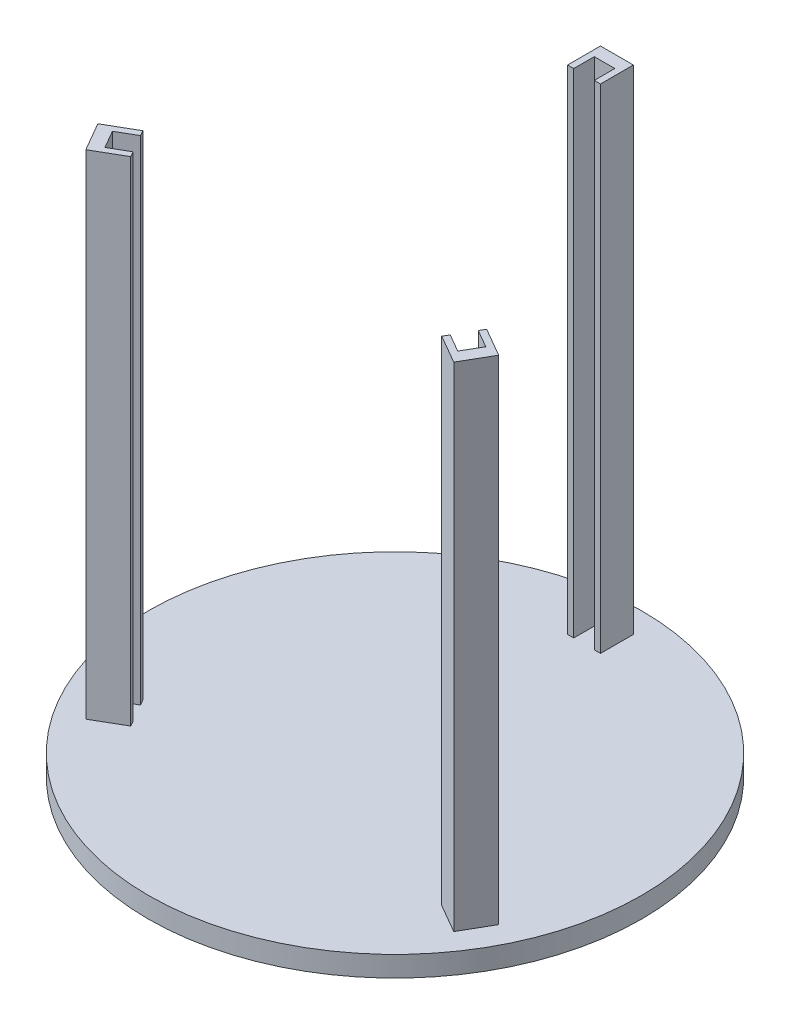
ISO-10303-21;
HEADER;
FILE_DESCRIPTION(('STEP AP214'),'2;1');
FILE_NAME('part.step','',(''),(''),'','','');
FILE_SCHEMA(('AUTOMOTIVE_DESIGN { 1 0 10303 214 1 1 1 1 }'));
ENDSEC;
DATA;
#1=APPLICATION_CONTEXT('core data for automotive mechanical design processes');
#2=APPLICATION_PROTOCOL_DEFINITION('international standard','automotive_design',2000,#1);
#3=PRODUCT_CONTEXT('',#1,'mechanical');
#4=PRODUCT('Part','Part','',(#3));
#5=PRODUCT_RELATED_PRODUCT_CATEGORY('part','',(#4));
#6=PRODUCT_DEFINITION_FORMATION('','',#4);
#7=PRODUCT_DEFINITION_CONTEXT('part definition',#1,'design');
#8=PRODUCT_DEFINITION('design','',#6,#7);
#9=PRODUCT_DEFINITION_SHAPE('','',#8);
#10=(LENGTH_UNIT() NAMED_UNIT(*) SI_UNIT(.MILLI.,.METRE.));
#11=(NAMED_UNIT(*) PLANE_ANGLE_UNIT() SI_UNIT($,.RADIAN.));
#12=(NAMED_UNIT(*) SI_UNIT($,.STERADIAN.) SOLID_ANGLE_UNIT());
#13=UNCERTAINTY_MEASURE_WITH_UNIT(LENGTH_MEASURE(1.E-05),#10,'distance_accuracy_value','');
#14=(GEOMETRIC_REPRESENTATION_CONTEXT(3) GLOBAL_UNCERTAINTY_ASSIGNED_CONTEXT((#13)) GLOBAL_UNIT_ASSIGNED_CONTEXT((#10,
#11,#12)) REPRESENTATION_CONTEXT('',''));
#15=CARTESIAN_POINT('',(0.,0.,0.));
#16=DIRECTION('',(0.,0.,1.));
#17=DIRECTION('',(1.,0.,0.));
#18=AXIS2_PLACEMENT_3D('',#15,#16,#17);
#19=CARTESIAN_POINT('',(209.185842870422,625.,97.6794919243093));
#20=DIRECTION('',(0.866025403784443,0.,0.499999999999992));
#21=DIRECTION('',(0.499999999999992,0.,-0.866025403784443));
#22=AXIS2_PLACEMENT_3D('',#19,#20,#21);
#23=PLANE('',#22);
#24=DIRECTION('',(-0.499999999999992,0.,0.866025403784443));
#25=VECTOR('',#24,1.);
#26=CARTESIAN_POINT('',(209.185842870422,25.,97.6794919243093));
#27=LINE('',#26,#25);
#28=CARTESIAN_POINT('',(209.185842870422,25.,97.6794919243093));
#29=VERTEX_POINT('',#28);
#30=CARTESIAN_POINT('',(205.45728406955,25.,104.137545206428));
#31=VERTEX_POINT('',#30);
#32=EDGE_CURVE('E218',#29,#31,#27,.T.);
#33=ORIENTED_EDGE('',*,*,#32,.T.);
#34=DIRECTION('',(0.,1.,0.));
#35=VECTOR('',#34,1.);
#36=CARTESIAN_POINT('',(205.45728406955,25.,104.137545206428));
#37=LINE('',#36,#35);
#38=CARTESIAN_POINT('',(205.45728406955,625.,104.137545206428));
#39=VERTEX_POINT('',#38);
#40=EDGE_CURVE('E468',#31,#39,#37,.T.);
#41=ORIENTED_EDGE('',*,*,#40,.T.);
#42=DIRECTION('',(-0.499999999999992,0.,0.866025403784443));
#43=VECTOR('',#42,1.);
#44=CARTESIAN_POINT('',(209.185842870422,625.,97.6794919243093));
#45=LINE('',#44,#43);
#46=CARTESIAN_POINT('',(209.185842870422,625.,97.6794919243093));
#47=VERTEX_POINT('',#46);
#48=EDGE_CURVE('E231',#47,#39,#45,.T.);
#49=ORIENTED_EDGE('',*,*,#48,.F.);
#50=DIRECTION('',(0.,-1.,0.));
#51=VECTOR('',#50,1.);
#52=CARTESIAN_POINT('',(209.185842870422,625.,97.6794919243093));
#53=LINE('',#52,#51);
#54=EDGE_CURVE('E230',#47,#29,#53,.T.);
#55=ORIENTED_EDGE('',*,*,#54,.T.);
#56=EDGE_LOOP('',(#33,#41,#49,#55));
#57=FACE_BOUND('',#56,.T.);
#58=ADVANCED_FACE('F33',(#57),#23,.F.);
#59=CARTESIAN_POINT('',(-189.18584287042,625.,132.32050807569));
#60=DIRECTION('',(-0.866025403784436,0.,0.500000000000004));
#61=DIRECTION('',(0.500000000000004,0.,0.866025403784436));
#62=AXIS2_PLACEMENT_3D('',#59,#60,#61);
#63=PLANE('',#62);
#64=DIRECTION('',(-0.500000000000004,0.,-0.866025403784436));
#65=VECTOR('',#64,1.);
#66=CARTESIAN_POINT('',(-189.18584287042,25.,132.32050807569));
#67=LINE('',#66,#65);
#68=CARTESIAN_POINT('',(-189.18584287042,25.,132.32050807569));
#69=VERTEX_POINT('',#68);
#70=CARTESIAN_POINT('',(-192.914401671292,25.,125.862454793572));
#71=VERTEX_POINT('',#70);
#72=EDGE_CURVE('E243',#69,#71,#67,.T.);
#73=ORIENTED_EDGE('',*,*,#72,.T.);
#74=DIRECTION('',(0.,1.,0.));
#75=VECTOR('',#74,1.);
#76=CARTESIAN_POINT('',(-192.914401671292,25.,125.862454793572));
#77=LINE('',#76,#75);
#78=CARTESIAN_POINT('',(-192.914401671292,625.,125.862454793572));
#79=VERTEX_POINT('',#78);
#80=EDGE_CURVE('E471',#71,#79,#77,.T.);
#81=ORIENTED_EDGE('',*,*,#80,.T.);
#82=DIRECTION('',(-0.500000000000004,0.,-0.866025403784436));
#83=VECTOR('',#82,1.);
#84=CARTESIAN_POINT('',(-189.18584287042,625.,132.32050807569));
#85=LINE('',#84,#83);
#86=CARTESIAN_POINT('',(-189.18584287042,625.,132.32050807569));
#87=VERTEX_POINT('',#86);
#88=EDGE_CURVE('E248',#87,#79,#85,.T.);
#89=ORIENTED_EDGE('',*,*,#88,.F.);
#90=DIRECTION('',(0.,-1.,0.));
#91=VECTOR('',#90,1.);
#92=CARTESIAN_POINT('',(-189.18584287042,625.,132.32050807569));
#93=LINE('',#92,#91);
#94=EDGE_CURVE('E264',#87,#69,#93,.T.);
#95=ORIENTED_EDGE('',*,*,#94,.T.);
#96=EDGE_LOOP('',(#73,#81,#89,#95));
#97=FACE_BOUND('',#96,.T.);
#98=ADVANCED_FACE('F349',(#97),#63,.F.);
#99=CARTESIAN_POINT('',(0.,25.,0.));
#100=DIRECTION('',(0.,1.,0.));
#101=DIRECTION('',(0.,0.,1.));
#102=AXIS2_PLACEMENT_3D('',#99,#100,#101);
#103=PLANE('',#102);
#104=CARTESIAN_POINT('',(0.,25.,0.));
#105=DIRECTION('',(0.,1.,0.));
#106=DIRECTION('',(0.,0.,1.));
#107=AXIS2_PLACEMENT_3D('',#104,#105,#106);
#108=CIRCLE('',#107,300.);
#109=CARTESIAN_POINT('',(0.,25.,300.));
#110=VERTEX_POINT('',#109);
#111=EDGE_CURVE('E11',#110,#110,#108,.T.);
#112=ORIENTED_EDGE('',*,*,#111,.T.);
#113=EDGE_LOOP('',(#112));
#114=FACE_BOUND('',#113,.T.);
#115=DIRECTION('',(-1.,0.,0.));
#116=VECTOR('',#115,1.);
#117=CARTESIAN_POINT('',(-20.,25.,-270.));
#118=LINE('',#117,#116);
#119=CARTESIAN_POINT('',(20.,25.,-270.));
#120=VERTEX_POINT('',#119);
#121=CARTESIAN_POINT('',(-20.,25.,-270.));
#122=VERTEX_POINT('',#121);
#123=EDGE_CURVE('E313',#120,#122,#118,.T.);
#124=ORIENTED_EDGE('',*,*,#123,.F.);
#125=DIRECTION('',(0.,0.,-1.));
#126=VECTOR('',#125,1.);
#127=CARTESIAN_POINT('',(20.,25.,-230.));
#128=LINE('',#127,#126);
#129=CARTESIAN_POINT('',(20.,25.,-230.));
#130=VERTEX_POINT('',#129);
#131=EDGE_CURVE('E292',#130,#120,#128,.T.);
#132=ORIENTED_EDGE('',*,*,#131,.F.);
#133=DIRECTION('',(1.,0.,0.));
#134=VECTOR('',#133,1.);
#135=CARTESIAN_POINT('',(-20.,25.,-230.));
#136=LINE('',#135,#134);
#137=CARTESIAN_POINT('',(12.4571176017438,25.,-230.));
#138=VERTEX_POINT('',#137);
#139=EDGE_CURVE('E318',#138,#130,#136,.T.);
#140=ORIENTED_EDGE('',*,*,#139,.F.);
#141=DIRECTION('',(0.,0.,-1.));
#142=VECTOR('',#141,1.);
#143=CARTESIAN_POINT('',(12.4571176017438,25.,-255.));
#144=LINE('',#143,#142);
#145=CARTESIAN_POINT('',(12.4571176017438,25.,-255.));
#146=VERTEX_POINT('',#145);
#147=EDGE_CURVE('E272',#138,#146,#144,.T.);
#148=ORIENTED_EDGE('',*,*,#147,.T.);
#149=DIRECTION('',(-1.,0.,0.));
#150=VECTOR('',#149,1.);
#151=CARTESIAN_POINT('',(-12.5428823982562,25.,-255.));
#152=LINE('',#151,#150);
#153=CARTESIAN_POINT('',(-12.5428823982562,25.,-255.));
#154=VERTEX_POINT('',#153);
#155=EDGE_CURVE('E275',#146,#154,#152,.T.);
#156=ORIENTED_EDGE('',*,*,#155,.T.);
#157=DIRECTION('',(0.,0.,1.));
#158=VECTOR('',#157,1.);
#159=CARTESIAN_POINT('',(-12.5428823982562,25.,-230.));
#160=LINE('',#159,#158);
#161=CARTESIAN_POINT('',(-12.5428823982562,25.,-230.));
#162=VERTEX_POINT('',#161);
#163=EDGE_CURVE('E279',#154,#162,#160,.T.);
#164=ORIENTED_EDGE('',*,*,#163,.T.);
#165=CARTESIAN_POINT('',(-20.,25.,-230.));
#166=VERTEX_POINT('',#165);
#167=EDGE_CURVE('E302',#166,#162,#136,.T.);
#168=ORIENTED_EDGE('',*,*,#167,.F.);
#169=DIRECTION('',(0.,0.,1.));
#170=VECTOR('',#169,1.);
#171=CARTESIAN_POINT('',(-20.,25.,-230.));
#172=LINE('',#171,#170);
#173=EDGE_CURVE('E315',#122,#166,#172,.T.);
#174=ORIENTED_EDGE('',*,*,#173,.F.);
#175=EDGE_LOOP('',(#124,#132,#140,#148,#156,#164,#168,#174));
#176=FACE_BOUND('',#175,.T.);
#177=DIRECTION('',(0.500000000000004,0.,0.866025403784436));
#178=VECTOR('',#177,1.);
#179=CARTESIAN_POINT('',(-223.826859021798,25.,152.32050807569));
#180=LINE('',#179,#178);
#181=CARTESIAN_POINT('',(-243.826859021798,25.,117.679491924312));
#182=VERTEX_POINT('',#181);
#183=CARTESIAN_POINT('',(-223.826859021798,25.,152.32050807569));
#184=VERTEX_POINT('',#183);
#185=EDGE_CURVE('E254',#182,#184,#180,.T.);
#186=ORIENTED_EDGE('',*,*,#185,.F.);
#187=DIRECTION('',(-0.866025403784436,0.,0.500000000000004));
#188=VECTOR('',#187,1.);
#189=CARTESIAN_POINT('',(-209.18584287042,25.,97.6794919243122));
#190=LINE('',#189,#188);
#191=CARTESIAN_POINT('',(-209.18584287042,25.,97.6794919243122));
#192=VERTEX_POINT('',#191);
#193=EDGE_CURVE('E238',#192,#182,#190,.T.);
#194=ORIENTED_EDGE('',*,*,#193,.F.);
#195=CARTESIAN_POINT('',(-205.414401671292,25.,104.211819698961));
#196=VERTEX_POINT('',#195);
#197=EDGE_CURVE('E259',#196,#192,#67,.T.);
#198=ORIENTED_EDGE('',*,*,#197,.F.);
#199=DIRECTION('',(-0.866025403784436,0.,0.500000000000004));
#200=VECTOR('',#199,1.);
#201=CARTESIAN_POINT('',(-227.065036765903,25.,116.711819698961));
#202=LINE('',#201,#200);
#203=CARTESIAN_POINT('',(-227.065036765903,25.,116.711819698961));
#204=VERTEX_POINT('',#203);
#205=EDGE_CURVE('E452',#196,#204,#202,.T.);
#206=ORIENTED_EDGE('',*,*,#205,.T.);
#207=DIRECTION('',(0.500000000000002,0.,0.866025403784438));
#208=VECTOR('',#207,1.);
#209=CARTESIAN_POINT('',(-214.565036765903,25.,138.362454793572));
#210=LINE('',#209,#208);
#211=CARTESIAN_POINT('',(-214.565036765903,25.,138.362454793572));
#212=VERTEX_POINT('',#211);
#213=EDGE_CURVE('E455',#204,#212,#210,.T.);
#214=ORIENTED_EDGE('',*,*,#213,.T.);
#215=DIRECTION('',(0.866025403784436,0.,-0.500000000000004));
#216=VECTOR('',#215,1.);
#217=CARTESIAN_POINT('',(-192.914401671292,25.,125.862454793572));
#218=LINE('',#217,#216);
#219=EDGE_CURVE('E459',#212,#71,#218,.T.);
#220=ORIENTED_EDGE('',*,*,#219,.T.);
#221=ORIENTED_EDGE('',*,*,#72,.F.);
#222=DIRECTION('',(0.866025403784436,0.,-0.500000000000004));
#223=VECTOR('',#222,1.);
#224=CARTESIAN_POINT('',(-189.18584287042,25.,132.32050807569));
#225=LINE('',#224,#223);
#226=EDGE_CURVE('E256',#184,#69,#225,.T.);
#227=ORIENTED_EDGE('',*,*,#226,.F.);
#228=EDGE_LOOP('',(#186,#194,#198,#206,#214,#220,#221,#227));
#229=FACE_BOUND('',#228,.T.);
#230=DIRECTION('',(0.499999999999992,0.,-0.866025403784443));
#231=VECTOR('',#230,1.);
#232=CARTESIAN_POINT('',(243.8268590218,25.,117.679491924309));
#233=LINE('',#232,#231);
#234=CARTESIAN_POINT('',(223.8268590218,25.,152.320508075687));
#235=VERTEX_POINT('',#234);
#236=CARTESIAN_POINT('',(243.8268590218,25.,117.679491924309));
#237=VERTEX_POINT('',#236);
#238=EDGE_CURVE('E224',#235,#237,#233,.T.);
#239=ORIENTED_EDGE('',*,*,#238,.F.);
#240=DIRECTION('',(0.866025403784443,0.,0.499999999999992));
#241=VECTOR('',#240,1.);
#242=CARTESIAN_POINT('',(189.185842870422,25.,132.320508075687));
#243=LINE('',#242,#241);
#244=CARTESIAN_POINT('',(189.185842870422,25.,132.320508075687));
#245=VERTEX_POINT('',#244);
#246=EDGE_CURVE('E217',#245,#235,#243,.T.);
#247=ORIENTED_EDGE('',*,*,#246,.F.);
#248=CARTESIAN_POINT('',(192.95728406955,25.,125.788180301039));
#249=VERTEX_POINT('',#248);
#250=EDGE_CURVE('E208',#249,#245,#27,.T.);
#251=ORIENTED_EDGE('',*,*,#250,.F.);
#252=DIRECTION('',(0.866025403784443,0.,0.499999999999992));
#253=VECTOR('',#252,1.);
#254=CARTESIAN_POINT('',(214.607919164161,25.,138.288180301038));
#255=LINE('',#254,#253);
#256=CARTESIAN_POINT('',(214.607919164161,25.,138.288180301038));
#257=VERTEX_POINT('',#256);
#258=EDGE_CURVE('E194',#249,#257,#255,.T.);
#259=ORIENTED_EDGE('',*,*,#258,.T.);
#260=DIRECTION('',(0.499999999999994,0.,-0.866025403784442));
#261=VECTOR('',#260,1.);
#262=CARTESIAN_POINT('',(227.107919164161,25.,116.637545206427));
#263=LINE('',#262,#261);
#264=CARTESIAN_POINT('',(227.107919164161,25.,116.637545206427));
#265=VERTEX_POINT('',#264);
#266=EDGE_CURVE('E201',#257,#265,#263,.T.);
#267=ORIENTED_EDGE('',*,*,#266,.T.);
#268=DIRECTION('',(-0.866025403784443,0.,-0.499999999999992));
#269=VECTOR('',#268,1.);
#270=CARTESIAN_POINT('',(205.45728406955,25.,104.137545206428));
#271=LINE('',#270,#269);
#272=EDGE_CURVE('E211',#265,#31,#271,.T.);
#273=ORIENTED_EDGE('',*,*,#272,.T.);
#274=ORIENTED_EDGE('',*,*,#32,.F.);
#275=DIRECTION('',(-0.866025403784443,0.,-0.499999999999992));
#276=VECTOR('',#275,1.);
#277=CARTESIAN_POINT('',(209.185842870422,25.,97.6794919243093));
#278=LINE('',#277,#276);
#279=EDGE_CURVE('E219',#237,#29,#278,.T.);
#280=ORIENTED_EDGE('',*,*,#279,.F.);
#281=EDGE_LOOP('',(#239,#247,#251,#259,#267,#273,#274,#280));
#282=FACE_BOUND('',#281,.T.);
#283=ADVANCED_FACE('F215',(#114,#176,#229,#282),#103,.T.);
#284=CARTESIAN_POINT('',(-20.,625.,-230.));
#285=DIRECTION('',(0.,0.,-1.));
#286=DIRECTION('',(-1.,0.,0.));
#287=AXIS2_PLACEMENT_3D('',#284,#285,#286);
#288=PLANE('',#287);
#289=ORIENTED_EDGE('',*,*,#167,.T.);
#290=DIRECTION('',(0.,1.,0.));
#291=VECTOR('',#290,1.);
#292=CARTESIAN_POINT('',(-12.5428823982562,25.,-230.));
#293=LINE('',#292,#291);
#294=CARTESIAN_POINT('',(-12.5428823982562,625.,-230.));
#295=VERTEX_POINT('',#294);
#296=EDGE_CURVE('E289',#162,#295,#293,.T.);
#297=ORIENTED_EDGE('',*,*,#296,.T.);
#298=DIRECTION('',(1.,0.,0.));
#299=VECTOR('',#298,1.);
#300=CARTESIAN_POINT('',(-20.,625.,-230.));
#301=LINE('',#300,#299);
#302=CARTESIAN_POINT('',(-20.,625.,-230.));
#303=VERTEX_POINT('',#302);
#304=EDGE_CURVE('E307',#303,#295,#301,.T.);
#305=ORIENTED_EDGE('',*,*,#304,.F.);
#306=DIRECTION('',(0.,-1.,0.));
#307=VECTOR('',#306,1.);
#308=CARTESIAN_POINT('',(-20.,625.,-230.));
#309=LINE('',#308,#307);
#310=EDGE_CURVE('E323',#303,#166,#309,.T.);
#311=ORIENTED_EDGE('',*,*,#310,.T.);
#312=EDGE_LOOP('',(#289,#297,#305,#311));
#313=FACE_BOUND('',#312,.T.);
#314=ADVANCED_FACE('F345',(#313),#288,.F.);
#315=CARTESIAN_POINT('',(0.,25.,0.));
#316=DIRECTION('',(0.,-1.,0.));
#317=DIRECTION('',(0.,0.,-1.));
#318=AXIS2_PLACEMENT_3D('',#315,#316,#317);
#319=CYLINDRICAL_SURFACE('',#318,300.);
#320=ORIENTED_EDGE('',*,*,#111,.F.);
#321=EDGE_LOOP('',(#320));
#322=FACE_BOUND('',#321,.T.);
#323=CARTESIAN_POINT('',(0.,0.,0.));
#324=DIRECTION('',(0.,1.,0.));
#325=DIRECTION('',(0.,0.,1.));
#326=AXIS2_PLACEMENT_3D('',#323,#324,#325);
#327=CIRCLE('',#326,300.);
#328=CARTESIAN_POINT('',(0.,0.,300.));
#329=VERTEX_POINT('',#328);
#330=EDGE_CURVE('E37',#329,#329,#327,.T.);
#331=ORIENTED_EDGE('',*,*,#330,.T.);
#332=EDGE_LOOP('',(#331));
#333=FACE_BOUND('',#332,.T.);
#334=ADVANCED_FACE('F35',(#322,#333),#319,.T.);
#335=CARTESIAN_POINT('',(0.,0.,0.));
#336=DIRECTION('',(0.,1.,0.));
#337=DIRECTION('',(0.,0.,1.));
#338=AXIS2_PLACEMENT_3D('',#335,#336,#337);
#339=PLANE('',#338);
#340=ORIENTED_EDGE('',*,*,#330,.F.);
#341=EDGE_LOOP('',(#340));
#342=FACE_BOUND('',#341,.T.);
#343=ADVANCED_FACE('F335',(#342),#339,.F.);
#344=CARTESIAN_POINT('',(20.,625.,-230.));
#345=DIRECTION('',(-1.,0.,0.));
#346=DIRECTION('',(0.,0.,1.));
#347=AXIS2_PLACEMENT_3D('',#344,#345,#346);
#348=PLANE('',#347);
#349=ORIENTED_EDGE('',*,*,#131,.T.);
#350=DIRECTION('',(0.,-1.,0.));
#351=VECTOR('',#350,1.);
#352=CARTESIAN_POINT('',(20.,625.,-270.));
#353=LINE('',#352,#351);
#354=CARTESIAN_POINT('',(20.,625.,-270.));
#355=VERTEX_POINT('',#354);
#356=EDGE_CURVE('E328',#355,#120,#353,.T.);
#357=ORIENTED_EDGE('',*,*,#356,.F.);
#358=DIRECTION('',(0.,0.,-1.));
#359=VECTOR('',#358,1.);
#360=CARTESIAN_POINT('',(20.,625.,-230.));
#361=LINE('',#360,#359);
#362=CARTESIAN_POINT('',(20.,625.,-230.));
#363=VERTEX_POINT('',#362);
#364=EDGE_CURVE('E298',#363,#355,#361,.T.);
#365=ORIENTED_EDGE('',*,*,#364,.F.);
#366=DIRECTION('',(0.,-1.,0.));
#367=VECTOR('',#366,1.);
#368=CARTESIAN_POINT('',(20.,625.,-230.));
#369=LINE('',#368,#367);
#370=EDGE_CURVE('E310',#363,#130,#369,.T.);
#371=ORIENTED_EDGE('',*,*,#370,.T.);
#372=EDGE_LOOP('',(#349,#357,#365,#371));
#373=FACE_BOUND('',#372,.T.);
#374=ADVANCED_FACE('F337',(#373),#348,.F.);
#375=CARTESIAN_POINT('',(-20.,625.,-270.));
#376=DIRECTION('',(0.,0.,1.));
#377=DIRECTION('',(1.,0.,0.));
#378=AXIS2_PLACEMENT_3D('',#375,#376,#377);
#379=PLANE('',#378);
#380=ORIENTED_EDGE('',*,*,#123,.T.);
#381=DIRECTION('',(0.,-1.,0.));
#382=VECTOR('',#381,1.);
#383=CARTESIAN_POINT('',(-20.,625.,-270.));
#384=LINE('',#383,#382);
#385=CARTESIAN_POINT('',(-20.,625.,-270.));
#386=VERTEX_POINT('',#385);
#387=EDGE_CURVE('E325',#386,#122,#384,.T.);
#388=ORIENTED_EDGE('',*,*,#387,.F.);
#389=DIRECTION('',(-1.,0.,0.));
#390=VECTOR('',#389,1.);
#391=CARTESIAN_POINT('',(-20.,625.,-270.));
#392=LINE('',#391,#390);
#393=EDGE_CURVE('E301',#355,#386,#392,.T.);
#394=ORIENTED_EDGE('',*,*,#393,.F.);
#395=ORIENTED_EDGE('',*,*,#356,.T.);
#396=EDGE_LOOP('',(#380,#388,#394,#395));
#397=FACE_BOUND('',#396,.T.);
#398=ADVANCED_FACE('F342',(#397),#379,.F.);
#399=CARTESIAN_POINT('',(-20.,625.,-230.));
#400=DIRECTION('',(1.,0.,0.));
#401=DIRECTION('',(0.,0.,-1.));
#402=AXIS2_PLACEMENT_3D('',#399,#400,#401);
#403=PLANE('',#402);
#404=ORIENTED_EDGE('',*,*,#173,.T.);
#405=ORIENTED_EDGE('',*,*,#310,.F.);
#406=DIRECTION('',(0.,0.,1.));
#407=VECTOR('',#406,1.);
#408=CARTESIAN_POINT('',(-20.,625.,-230.));
#409=LINE('',#408,#407);
#410=EDGE_CURVE('E304',#386,#303,#409,.T.);
#411=ORIENTED_EDGE('',*,*,#410,.F.);
#412=ORIENTED_EDGE('',*,*,#387,.T.);
#413=EDGE_LOOP('',(#404,#405,#411,#412));
#414=FACE_BOUND('',#413,.T.);
#415=ADVANCED_FACE('F418',(#414),#403,.F.);
#416=CARTESIAN_POINT('',(12.4571176017438,625.,-230.));
#417=VERTEX_POINT('',#416);
#418=EDGE_CURVE('E306',#417,#363,#301,.T.);
#419=ORIENTED_EDGE('',*,*,#418,.F.);
#420=DIRECTION('',(0.,1.,0.));
#421=VECTOR('',#420,1.);
#422=CARTESIAN_POINT('',(12.4571176017438,25.,-230.));
#423=LINE('',#422,#421);
#424=EDGE_CURVE('E282',#138,#417,#423,.T.);
#425=ORIENTED_EDGE('',*,*,#424,.F.);
#426=ORIENTED_EDGE('',*,*,#139,.T.);
#427=ORIENTED_EDGE('',*,*,#370,.F.);
#428=EDGE_LOOP('',(#419,#425,#426,#427));
#429=FACE_BOUND('',#428,.T.);
#430=ADVANCED_FACE('F414',(#429),#288,.F.);
#431=CARTESIAN_POINT('',(0.,625.,0.));
#432=DIRECTION('',(0.,-1.,0.));
#433=DIRECTION('',(0.,0.,-1.));
#434=AXIS2_PLACEMENT_3D('',#431,#432,#433);
#435=PLANE('',#434);
#436=ORIENTED_EDGE('',*,*,#304,.T.);
#437=DIRECTION('',(0.,0.,1.));
#438=VECTOR('',#437,1.);
#439=CARTESIAN_POINT('',(-12.5428823982562,625.,-230.));
#440=LINE('',#439,#438);
#441=CARTESIAN_POINT('',(-12.5428823982562,625.,-255.));
#442=VERTEX_POINT('',#441);
#443=EDGE_CURVE('E276',#442,#295,#440,.T.);
#444=ORIENTED_EDGE('',*,*,#443,.F.);
#445=DIRECTION('',(-1.,0.,0.));
#446=VECTOR('',#445,1.);
#447=CARTESIAN_POINT('',(-12.5428823982562,625.,-255.));
#448=LINE('',#447,#446);
#449=CARTESIAN_POINT('',(12.4571176017438,625.,-255.));
#450=VERTEX_POINT('',#449);
#451=EDGE_CURVE('E285',#450,#442,#448,.T.);
#452=ORIENTED_EDGE('',*,*,#451,.F.);
#453=DIRECTION('',(0.,0.,-1.));
#454=VECTOR('',#453,1.);
#455=CARTESIAN_POINT('',(12.4571176017438,625.,-255.));
#456=LINE('',#455,#454);
#457=EDGE_CURVE('E271',#417,#450,#456,.T.);
#458=ORIENTED_EDGE('',*,*,#457,.F.);
#459=ORIENTED_EDGE('',*,*,#418,.T.);
#460=ORIENTED_EDGE('',*,*,#364,.T.);
#461=ORIENTED_EDGE('',*,*,#393,.T.);
#462=ORIENTED_EDGE('',*,*,#410,.T.);
#463=EDGE_LOOP('',(#436,#444,#452,#458,#459,#460,#461,#462));
#464=FACE_BOUND('',#463,.T.);
#465=ADVANCED_FACE('F404',(#464),#435,.F.);
#466=CARTESIAN_POINT('',(-12.5428823982562,25.,-230.));
#467=DIRECTION('',(-1.,0.,0.));
#468=DIRECTION('',(0.,0.,1.));
#469=AXIS2_PLACEMENT_3D('',#466,#467,#468);
#470=PLANE('',#469);
#471=ORIENTED_EDGE('',*,*,#443,.T.);
#472=ORIENTED_EDGE('',*,*,#296,.F.);
#473=ORIENTED_EDGE('',*,*,#163,.F.);
#474=DIRECTION('',(0.,1.,0.));
#475=VECTOR('',#474,1.);
#476=CARTESIAN_POINT('',(-12.5428823982562,25.,-255.));
#477=LINE('',#476,#475);
#478=EDGE_CURVE('E293',#154,#442,#477,.T.);
#479=ORIENTED_EDGE('',*,*,#478,.T.);
#480=EDGE_LOOP('',(#471,#472,#473,#479));
#481=FACE_BOUND('',#480,.T.);
#482=ADVANCED_FACE('F400',(#481),#470,.F.);
#483=CARTESIAN_POINT('',(-12.5428823982562,25.,-255.));
#484=DIRECTION('',(0.,0.,-1.));
#485=DIRECTION('',(-1.,0.,0.));
#486=AXIS2_PLACEMENT_3D('',#483,#484,#485);
#487=PLANE('',#486);
#488=ORIENTED_EDGE('',*,*,#451,.T.);
#489=ORIENTED_EDGE('',*,*,#478,.F.);
#490=ORIENTED_EDGE('',*,*,#155,.F.);
#491=DIRECTION('',(0.,1.,0.));
#492=VECTOR('',#491,1.);
#493=CARTESIAN_POINT('',(12.4571176017438,25.,-255.));
#494=LINE('',#493,#492);
#495=EDGE_CURVE('E295',#146,#450,#494,.T.);
#496=ORIENTED_EDGE('',*,*,#495,.T.);
#497=EDGE_LOOP('',(#488,#489,#490,#496));
#498=FACE_BOUND('',#497,.T.);
#499=ADVANCED_FACE('F403',(#498),#487,.F.);
#500=CARTESIAN_POINT('',(12.4571176017438,25.,-255.));
#501=DIRECTION('',(1.,0.,0.));
#502=DIRECTION('',(0.,0.,-1.));
#503=AXIS2_PLACEMENT_3D('',#500,#501,#502);
#504=PLANE('',#503);
#505=ORIENTED_EDGE('',*,*,#457,.T.);
#506=ORIENTED_EDGE('',*,*,#495,.F.);
#507=ORIENTED_EDGE('',*,*,#147,.F.);
#508=ORIENTED_EDGE('',*,*,#424,.T.);
#509=EDGE_LOOP('',(#505,#506,#507,#508));
#510=FACE_BOUND('',#509,.T.);
#511=ADVANCED_FACE('F398',(#510),#504,.F.);
#512=CARTESIAN_POINT('',(-209.18584287042,625.,97.6794919243122));
#513=DIRECTION('',(0.500000000000004,0.,0.866025403784436));
#514=DIRECTION('',(0.866025403784436,0.,-0.500000000000004));
#515=AXIS2_PLACEMENT_3D('',#512,#513,#514);
#516=PLANE('',#515);
#517=ORIENTED_EDGE('',*,*,#193,.T.);
#518=DIRECTION('',(0.,-1.,0.));
#519=VECTOR('',#518,1.);
#520=CARTESIAN_POINT('',(-243.826859021798,625.,117.679491924312));
#521=LINE('',#520,#519);
#522=CARTESIAN_POINT('',(-243.826859021798,625.,117.679491924312));
#523=VERTEX_POINT('',#522);
#524=EDGE_CURVE('E269',#523,#182,#521,.T.);
#525=ORIENTED_EDGE('',*,*,#524,.F.);
#526=DIRECTION('',(-0.866025403784436,0.,0.500000000000004));
#527=VECTOR('',#526,1.);
#528=CARTESIAN_POINT('',(-209.18584287042,625.,97.6794919243122));
#529=LINE('',#528,#527);
#530=CARTESIAN_POINT('',(-209.18584287042,625.,97.6794919243122));
#531=VERTEX_POINT('',#530);
#532=EDGE_CURVE('E239',#531,#523,#529,.T.);
#533=ORIENTED_EDGE('',*,*,#532,.F.);
#534=DIRECTION('',(0.,-1.,0.));
#535=VECTOR('',#534,1.);
#536=CARTESIAN_POINT('',(-209.18584287042,625.,97.6794919243122));
#537=LINE('',#536,#535);
#538=EDGE_CURVE('E251',#531,#192,#537,.T.);
#539=ORIENTED_EDGE('',*,*,#538,.T.);
#540=EDGE_LOOP('',(#517,#525,#533,#539));
#541=FACE_BOUND('',#540,.T.);
#542=ADVANCED_FACE('F394',(#541),#516,.F.);
#543=CARTESIAN_POINT('',(-223.826859021798,625.,152.32050807569));
#544=DIRECTION('',(0.866025403784436,0.,-0.500000000000004));
#545=DIRECTION('',(-0.500000000000004,0.,-0.866025403784436));
#546=AXIS2_PLACEMENT_3D('',#543,#544,#545);
#547=PLANE('',#546);
#548=ORIENTED_EDGE('',*,*,#185,.T.);
#549=DIRECTION('',(0.,-1.,0.));
#550=VECTOR('',#549,1.);
#551=CARTESIAN_POINT('',(-223.826859021798,625.,152.32050807569));
#552=LINE('',#551,#550);
#553=CARTESIAN_POINT('',(-223.826859021798,625.,152.32050807569));
#554=VERTEX_POINT('',#553);
#555=EDGE_CURVE('E266',#554,#184,#552,.T.);
#556=ORIENTED_EDGE('',*,*,#555,.F.);
#557=DIRECTION('',(0.500000000000004,0.,0.866025403784436));
#558=VECTOR('',#557,1.);
#559=CARTESIAN_POINT('',(-223.826859021798,625.,152.32050807569));
#560=LINE('',#559,#558);
#561=EDGE_CURVE('E242',#523,#554,#560,.T.);
#562=ORIENTED_EDGE('',*,*,#561,.F.);
#563=ORIENTED_EDGE('',*,*,#524,.T.);
#564=EDGE_LOOP('',(#548,#556,#562,#563));
#565=FACE_BOUND('',#564,.T.);
#566=ADVANCED_FACE('F390',(#565),#547,.F.);
#567=CARTESIAN_POINT('',(-189.18584287042,625.,132.32050807569));
#568=DIRECTION('',(-0.500000000000004,0.,-0.866025403784436));
#569=DIRECTION('',(-0.866025403784436,0.,0.500000000000004));
#570=AXIS2_PLACEMENT_3D('',#567,#568,#569);
#571=PLANE('',#570);
#572=ORIENTED_EDGE('',*,*,#226,.T.);
#573=ORIENTED_EDGE('',*,*,#94,.F.);
#574=DIRECTION('',(0.866025403784436,0.,-0.500000000000004));
#575=VECTOR('',#574,1.);
#576=CARTESIAN_POINT('',(-189.18584287042,625.,132.32050807569));
#577=LINE('',#576,#575);
#578=EDGE_CURVE('E245',#554,#87,#577,.T.);
#579=ORIENTED_EDGE('',*,*,#578,.F.);
#580=ORIENTED_EDGE('',*,*,#555,.T.);
#581=EDGE_LOOP('',(#572,#573,#579,#580));
#582=FACE_BOUND('',#581,.T.);
#583=ADVANCED_FACE('F386',(#582),#571,.F.);
#584=CARTESIAN_POINT('',(-205.414401671292,625.,104.211819698961));
#585=VERTEX_POINT('',#584);
#586=EDGE_CURVE('E247',#585,#531,#85,.T.);
#587=ORIENTED_EDGE('',*,*,#586,.F.);
#588=DIRECTION('',(0.,1.,0.));
#589=VECTOR('',#588,1.);
#590=CARTESIAN_POINT('',(-205.414401671292,25.,104.211819698961));
#591=LINE('',#590,#589);
#592=EDGE_CURVE('E56',#196,#585,#591,.T.);
#593=ORIENTED_EDGE('',*,*,#592,.F.);
#594=ORIENTED_EDGE('',*,*,#197,.T.);
#595=ORIENTED_EDGE('',*,*,#538,.F.);
#596=EDGE_LOOP('',(#587,#593,#594,#595));
#597=FACE_BOUND('',#596,.T.);
#598=ADVANCED_FACE('F357',(#597),#63,.F.);
#599=CARTESIAN_POINT('',(0.,625.,0.));
#600=DIRECTION('',(0.,-1.,0.));
#601=DIRECTION('',(-0.866025403784436,0.,0.500000000000004));
#602=AXIS2_PLACEMENT_3D('',#599,#600,#601);
#603=PLANE('',#602);
#604=ORIENTED_EDGE('',*,*,#88,.T.);
#605=DIRECTION('',(0.866025403784436,0.,-0.500000000000004));
#606=VECTOR('',#605,1.);
#607=CARTESIAN_POINT('',(-192.914401671292,625.,125.862454793572));
#608=LINE('',#607,#606);
#609=CARTESIAN_POINT('',(-214.565036765903,625.,138.362454793572));
#610=VERTEX_POINT('',#609);
#611=EDGE_CURVE('E457',#610,#79,#608,.T.);
#612=ORIENTED_EDGE('',*,*,#611,.F.);
#613=DIRECTION('',(0.500000000000002,0.,0.866025403784438));
#614=VECTOR('',#613,1.);
#615=CARTESIAN_POINT('',(-214.565036765903,625.,138.362454793572));
#616=LINE('',#615,#614);
#617=CARTESIAN_POINT('',(-227.065036765903,625.,116.711819698961));
#618=VERTEX_POINT('',#617);
#619=EDGE_CURVE('E461',#618,#610,#616,.T.);
#620=ORIENTED_EDGE('',*,*,#619,.F.);
#621=DIRECTION('',(-0.866025403784436,0.,0.500000000000004));
#622=VECTOR('',#621,1.);
#623=CARTESIAN_POINT('',(-227.065036765903,625.,116.711819698961));
#624=LINE('',#623,#622);
#625=EDGE_CURVE('E466',#585,#618,#624,.T.);
#626=ORIENTED_EDGE('',*,*,#625,.F.);
#627=ORIENTED_EDGE('',*,*,#586,.T.);
#628=ORIENTED_EDGE('',*,*,#532,.T.);
#629=ORIENTED_EDGE('',*,*,#561,.T.);
#630=ORIENTED_EDGE('',*,*,#578,.T.);
#631=EDGE_LOOP('',(#604,#612,#620,#626,#627,#628,#629,#630));
#632=FACE_BOUND('',#631,.T.);
#633=ADVANCED_FACE('F380',(#632),#603,.F.);
#634=CARTESIAN_POINT('',(189.185842870422,625.,132.320508075687));
#635=DIRECTION('',(0.499999999999992,0.,-0.866025403784443));
#636=DIRECTION('',(-0.866025403784443,0.,-0.499999999999992));
#637=AXIS2_PLACEMENT_3D('',#634,#635,#636);
#638=PLANE('',#637);
#639=ORIENTED_EDGE('',*,*,#246,.T.);
#640=DIRECTION('',(0.,-1.,0.));
#641=VECTOR('',#640,1.);
#642=CARTESIAN_POINT('',(223.8268590218,625.,152.320508075687));
#643=LINE('',#642,#641);
#644=CARTESIAN_POINT('',(223.8268590218,625.,152.320508075687));
#645=VERTEX_POINT('',#644);
#646=EDGE_CURVE('E236',#645,#235,#643,.T.);
#647=ORIENTED_EDGE('',*,*,#646,.F.);
#648=DIRECTION('',(0.866025403784443,0.,0.499999999999992));
#649=VECTOR('',#648,1.);
#650=CARTESIAN_POINT('',(189.185842870422,625.,132.320508075687));
#651=LINE('',#650,#649);
#652=CARTESIAN_POINT('',(189.185842870422,625.,132.320508075687));
#653=VERTEX_POINT('',#652);
#654=EDGE_CURVE('E222',#653,#645,#651,.T.);
#655=ORIENTED_EDGE('',*,*,#654,.F.);
#656=DIRECTION('',(0.,-1.,0.));
#657=VECTOR('',#656,1.);
#658=CARTESIAN_POINT('',(189.185842870422,625.,132.320508075687));
#659=LINE('',#658,#657);
#660=EDGE_CURVE('E228',#653,#245,#659,.T.);
#661=ORIENTED_EDGE('',*,*,#660,.T.);
#662=EDGE_LOOP('',(#639,#647,#655,#661));
#663=FACE_BOUND('',#662,.T.);
#664=ADVANCED_FACE('F374',(#663),#638,.F.);
#665=CARTESIAN_POINT('',(243.8268590218,625.,117.679491924309));
#666=DIRECTION('',(-0.866025403784443,0.,-0.499999999999992));
#667=DIRECTION('',(-0.499999999999992,0.,0.866025403784443));
#668=AXIS2_PLACEMENT_3D('',#665,#666,#667);
#669=PLANE('',#668);
#670=ORIENTED_EDGE('',*,*,#238,.T.);
#671=DIRECTION('',(0.,-1.,0.));
#672=VECTOR('',#671,1.);
#673=CARTESIAN_POINT('',(243.8268590218,625.,117.679491924309));
#674=LINE('',#673,#672);
#675=CARTESIAN_POINT('',(243.8268590218,625.,117.679491924309));
#676=VERTEX_POINT('',#675);
#677=EDGE_CURVE('E233',#676,#237,#674,.T.);
#678=ORIENTED_EDGE('',*,*,#677,.F.);
#679=DIRECTION('',(0.499999999999992,0.,-0.866025403784443));
#680=VECTOR('',#679,1.);
#681=CARTESIAN_POINT('',(243.8268590218,625.,117.679491924309));
#682=LINE('',#681,#680);
#683=EDGE_CURVE('E481',#645,#676,#682,.T.);
#684=ORIENTED_EDGE('',*,*,#683,.F.);
#685=ORIENTED_EDGE('',*,*,#646,.T.);
#686=EDGE_LOOP('',(#670,#678,#684,#685));
#687=FACE_BOUND('',#686,.T.);
#688=ADVANCED_FACE('F369',(#687),#669,.F.);
#689=CARTESIAN_POINT('',(209.185842870422,625.,97.6794919243093));
#690=DIRECTION('',(-0.499999999999992,0.,0.866025403784443));
#691=DIRECTION('',(0.866025403784443,0.,0.499999999999992));
#692=AXIS2_PLACEMENT_3D('',#689,#690,#691);
#693=PLANE('',#692);
#694=ORIENTED_EDGE('',*,*,#279,.T.);
#695=ORIENTED_EDGE('',*,*,#54,.F.);
#696=DIRECTION('',(-0.866025403784443,0.,-0.499999999999992));
#697=VECTOR('',#696,1.);
#698=CARTESIAN_POINT('',(209.185842870422,625.,97.6794919243093));
#699=LINE('',#698,#697);
#700=EDGE_CURVE('E483',#676,#47,#699,.T.);
#701=ORIENTED_EDGE('',*,*,#700,.F.);
#702=ORIENTED_EDGE('',*,*,#677,.T.);
#703=EDGE_LOOP('',(#694,#695,#701,#702));
#704=FACE_BOUND('',#703,.T.);
#705=ADVANCED_FACE('F362',(#704),#693,.F.);
#706=CARTESIAN_POINT('',(192.95728406955,625.,125.788180301039));
#707=VERTEX_POINT('',#706);
#708=EDGE_CURVE('E210',#707,#653,#45,.T.);
#709=ORIENTED_EDGE('',*,*,#708,.F.);
#710=DIRECTION('',(0.,1.,0.));
#711=VECTOR('',#710,1.);
#712=CARTESIAN_POINT('',(192.95728406955,25.,125.788180301039));
#713=LINE('',#712,#711);
#714=EDGE_CURVE('E48',#249,#707,#713,.T.);
#715=ORIENTED_EDGE('',*,*,#714,.F.);
#716=ORIENTED_EDGE('',*,*,#250,.T.);
#717=ORIENTED_EDGE('',*,*,#660,.F.);
#718=EDGE_LOOP('',(#709,#715,#716,#717));
#719=FACE_BOUND('',#718,.T.);
#720=ADVANCED_FACE('F206',(#719),#23,.F.);
#721=CARTESIAN_POINT('',(0.,625.,0.));
#722=DIRECTION('',(0.,-1.,0.));
#723=DIRECTION('',(0.866025403784443,0.,0.499999999999992));
#724=AXIS2_PLACEMENT_3D('',#721,#722,#723);
#725=PLANE('',#724);
#726=ORIENTED_EDGE('',*,*,#48,.T.);
#727=DIRECTION('',(-0.866025403784443,0.,-0.499999999999992));
#728=VECTOR('',#727,1.);
#729=CARTESIAN_POINT('',(205.45728406955,625.,104.137545206428));
#730=LINE('',#729,#728);
#731=CARTESIAN_POINT('',(227.107919164161,625.,116.637545206427));
#732=VERTEX_POINT('',#731);
#733=EDGE_CURVE('E202',#732,#39,#730,.T.);
#734=ORIENTED_EDGE('',*,*,#733,.F.);
#735=DIRECTION('',(0.499999999999994,0.,-0.866025403784442));
#736=VECTOR('',#735,1.);
#737=CARTESIAN_POINT('',(227.107919164161,625.,116.637545206427));
#738=LINE('',#737,#736);
#739=CARTESIAN_POINT('',(214.607919164161,625.,138.288180301038));
#740=VERTEX_POINT('',#739);
#741=EDGE_CURVE('E502',#740,#732,#738,.T.);
#742=ORIENTED_EDGE('',*,*,#741,.F.);
#743=DIRECTION('',(0.866025403784443,0.,0.499999999999992));
#744=VECTOR('',#743,1.);
#745=CARTESIAN_POINT('',(214.607919164161,625.,138.288180301038));
#746=LINE('',#745,#744);
#747=EDGE_CURVE('E500',#707,#740,#746,.T.);
#748=ORIENTED_EDGE('',*,*,#747,.F.);
#749=ORIENTED_EDGE('',*,*,#708,.T.);
#750=ORIENTED_EDGE('',*,*,#654,.T.);
#751=ORIENTED_EDGE('',*,*,#683,.T.);
#752=ORIENTED_EDGE('',*,*,#700,.T.);
#753=EDGE_LOOP('',(#726,#734,#742,#748,#749,#750,#751,#752));
#754=FACE_BOUND('',#753,.T.);
#755=ADVANCED_FACE('F361',(#754),#725,.F.);
#756=CARTESIAN_POINT('',(-192.914401671292,25.,125.862454793572));
#757=DIRECTION('',(0.500000000000004,0.,0.866025403784436));
#758=DIRECTION('',(0.866025403784436,0.,-0.500000000000004));
#759=AXIS2_PLACEMENT_3D('',#756,#757,#758);
#760=PLANE('',#759);
#761=ORIENTED_EDGE('',*,*,#611,.T.);
#762=ORIENTED_EDGE('',*,*,#80,.F.);
#763=ORIENTED_EDGE('',*,*,#219,.F.);
#764=DIRECTION('',(0.,1.,0.));
#765=VECTOR('',#764,1.);
#766=CARTESIAN_POINT('',(-214.565036765903,25.,138.362454793572));
#767=LINE('',#766,#765);
#768=EDGE_CURVE('E474',#212,#610,#767,.T.);
#769=ORIENTED_EDGE('',*,*,#768,.T.);
#770=EDGE_LOOP('',(#761,#762,#763,#769));
#771=FACE_BOUND('',#770,.T.);
#772=ADVANCED_FACE('F367',(#771),#760,.F.);
#773=CARTESIAN_POINT('',(-214.565036765903,25.,138.362454793572));
#774=DIRECTION('',(-0.866025403784438,0.,0.500000000000002));
#775=DIRECTION('',(0.500000000000002,0.,0.866025403784437));
#776=AXIS2_PLACEMENT_3D('',#773,#774,#775);
#777=PLANE('',#776);
#778=ORIENTED_EDGE('',*,*,#619,.T.);
#779=ORIENTED_EDGE('',*,*,#768,.F.);
#780=ORIENTED_EDGE('',*,*,#213,.F.);
#781=DIRECTION('',(0.,1.,0.));
#782=VECTOR('',#781,1.);
#783=CARTESIAN_POINT('',(-227.065036765903,25.,116.711819698961));
#784=LINE('',#783,#782);
#785=EDGE_CURVE('E476',#204,#618,#784,.T.);
#786=ORIENTED_EDGE('',*,*,#785,.T.);
#787=EDGE_LOOP('',(#778,#779,#780,#786));
#788=FACE_BOUND('',#787,.T.);
#789=ADVANCED_FACE('F523',(#788),#777,.F.);
#790=CARTESIAN_POINT('',(-227.065036765903,25.,116.711819698961));
#791=DIRECTION('',(-0.500000000000004,0.,-0.866025403784436));
#792=DIRECTION('',(-0.866025403784436,0.,0.500000000000004));
#793=AXIS2_PLACEMENT_3D('',#790,#791,#792);
#794=PLANE('',#793);
#795=ORIENTED_EDGE('',*,*,#625,.T.);
#796=ORIENTED_EDGE('',*,*,#785,.F.);
#797=ORIENTED_EDGE('',*,*,#205,.F.);
#798=ORIENTED_EDGE('',*,*,#592,.T.);
#799=EDGE_LOOP('',(#795,#796,#797,#798));
#800=FACE_BOUND('',#799,.T.);
#801=ADVANCED_FACE('F516',(#800),#794,.F.);
#802=CARTESIAN_POINT('',(205.45728406955,25.,104.137545206428));
#803=DIRECTION('',(0.499999999999992,0.,-0.866025403784443));
#804=DIRECTION('',(-0.866025403784443,0.,-0.499999999999992));
#805=AXIS2_PLACEMENT_3D('',#802,#803,#804);
#806=PLANE('',#805);
#807=ORIENTED_EDGE('',*,*,#733,.T.);
#808=ORIENTED_EDGE('',*,*,#40,.F.);
#809=ORIENTED_EDGE('',*,*,#272,.F.);
#810=DIRECTION('',(0.,1.,0.));
#811=VECTOR('',#810,1.);
#812=CARTESIAN_POINT('',(227.107919164161,25.,116.637545206427));
#813=LINE('',#812,#811);
#814=EDGE_CURVE('E510',#265,#732,#813,.T.);
#815=ORIENTED_EDGE('',*,*,#814,.T.);
#816=EDGE_LOOP('',(#807,#808,#809,#815));
#817=FACE_BOUND('',#816,.T.);
#818=ADVANCED_FACE('F514',(#817),#806,.F.);
#819=CARTESIAN_POINT('',(227.107919164161,25.,116.637545206427));
#820=DIRECTION('',(0.866025403784442,0.,0.499999999999994));
#821=DIRECTION('',(0.499999999999994,0.,-0.866025403784442));
#822=AXIS2_PLACEMENT_3D('',#819,#820,#821);
#823=PLANE('',#822);
#824=ORIENTED_EDGE('',*,*,#741,.T.);
#825=ORIENTED_EDGE('',*,*,#814,.F.);
#826=ORIENTED_EDGE('',*,*,#266,.F.);
#827=DIRECTION('',(0.,1.,0.));
#828=VECTOR('',#827,1.);
#829=CARTESIAN_POINT('',(214.607919164161,25.,138.288180301038));
#830=LINE('',#829,#828);
#831=EDGE_CURVE('E196',#257,#740,#830,.T.);
#832=ORIENTED_EDGE('',*,*,#831,.T.);
#833=EDGE_LOOP('',(#824,#825,#826,#832));
#834=FACE_BOUND('',#833,.T.);
#835=ADVANCED_FACE('F512',(#834),#823,.F.);
#836=CARTESIAN_POINT('',(214.607919164161,25.,138.288180301038));
#837=DIRECTION('',(-0.499999999999992,0.,0.866025403784443));
#838=DIRECTION('',(0.866025403784443,0.,0.499999999999992));
#839=AXIS2_PLACEMENT_3D('',#836,#837,#838);
#840=PLANE('',#839);
#841=ORIENTED_EDGE('',*,*,#747,.T.);
#842=ORIENTED_EDGE('',*,*,#831,.F.);
#843=ORIENTED_EDGE('',*,*,#258,.F.);
#844=ORIENTED_EDGE('',*,*,#714,.T.);
#845=EDGE_LOOP('',(#841,#842,#843,#844));
#846=FACE_BOUND('',#845,.T.);
#847=ADVANCED_FACE('F195',(#846),#840,.F.);
#848=CLOSED_SHELL('',(#58,#98,#283,#314,#334,#343,#374,#398,#415,#430,#465,#482,#499,#511,#542,
#566,#583,#598,#633,#664,#688,#705,#720,#755,#772,#789,#801,#818,#835,#847));
#849=MANIFOLD_SOLID_BREP('B2',#848);
#850=ADVANCED_BREP_SHAPE_REPRESENTATION('',(#18,#849),#14);
#851=SHAPE_DEFINITION_REPRESENTATION(#9,#850);
ENDSEC;
END-ISO-10303-21;
